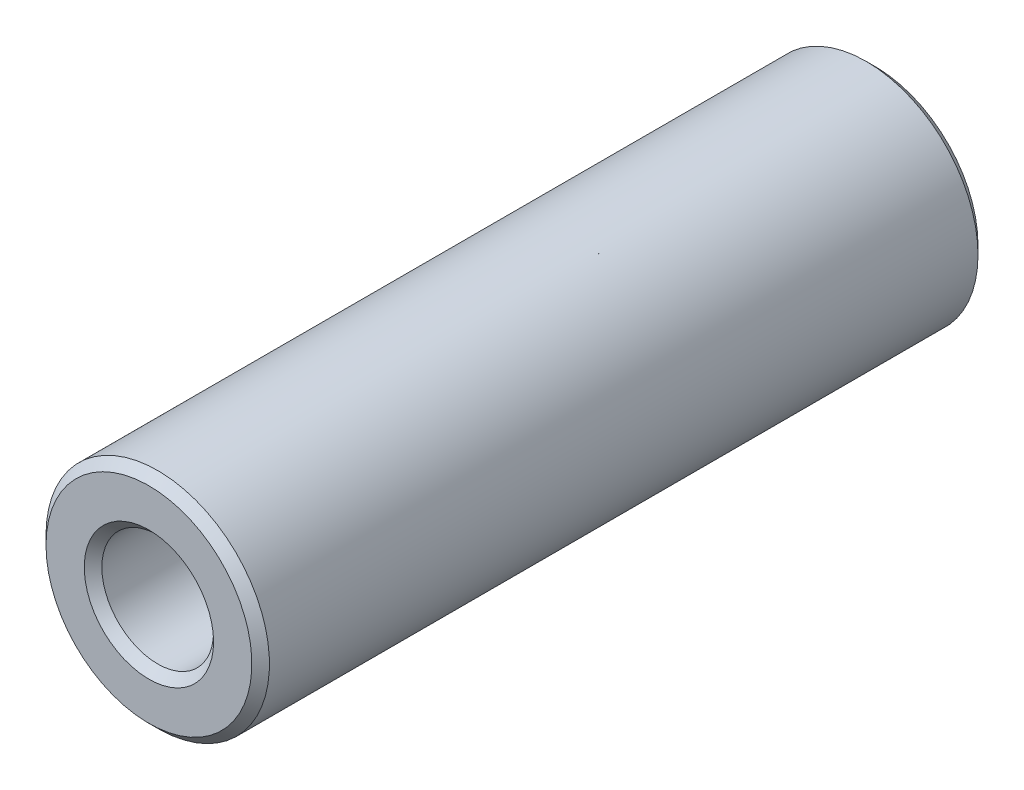
ISO-10303-21;
HEADER;
FILE_DESCRIPTION(('STEP AP214'),'2;1');
FILE_NAME('part.step','',(''),(''),'','','');
FILE_SCHEMA(('AUTOMOTIVE_DESIGN { 1 0 10303 214 1 1 1 1 }'));
ENDSEC;
DATA;
#1=APPLICATION_CONTEXT('core data for automotive mechanical design processes');
#2=APPLICATION_PROTOCOL_DEFINITION('international standard','automotive_design',2000,#1);
#3=PRODUCT_CONTEXT('',#1,'mechanical');
#4=PRODUCT('Part','Part','',(#3));
#5=PRODUCT_RELATED_PRODUCT_CATEGORY('part','',(#4));
#6=PRODUCT_DEFINITION_FORMATION('','',#4);
#7=PRODUCT_DEFINITION_CONTEXT('part definition',#1,'design');
#8=PRODUCT_DEFINITION('design','',#6,#7);
#9=PRODUCT_DEFINITION_SHAPE('','',#8);
#10=(LENGTH_UNIT() NAMED_UNIT(*) SI_UNIT(.MILLI.,.METRE.));
#11=(NAMED_UNIT(*) PLANE_ANGLE_UNIT() SI_UNIT($,.RADIAN.));
#12=(NAMED_UNIT(*) SI_UNIT($,.STERADIAN.) SOLID_ANGLE_UNIT());
#13=UNCERTAINTY_MEASURE_WITH_UNIT(LENGTH_MEASURE(1.E-05),#10,'distance_accuracy_value','');
#14=(GEOMETRIC_REPRESENTATION_CONTEXT(3) GLOBAL_UNCERTAINTY_ASSIGNED_CONTEXT((#13)) GLOBAL_UNIT_ASSIGNED_CONTEXT((#10,
#11,#12)) REPRESENTATION_CONTEXT('',''));
#15=CARTESIAN_POINT('',(0.,0.,0.));
#16=DIRECTION('',(0.,0.,1.));
#17=DIRECTION('',(1.,0.,0.));
#18=AXIS2_PLACEMENT_3D('',#15,#16,#17);
#19=CARTESIAN_POINT('',(0.,0.,41.275));
#20=DIRECTION('',(0.,0.,-1.));
#21=DIRECTION('',(-1.,0.,0.));
#22=AXIS2_PLACEMENT_3D('',#19,#20,#21);
#23=CYLINDRICAL_SURFACE('',#22,3.175);
#24=CARTESIAN_POINT('',(0.,0.,0.499999999988177));
#25=DIRECTION('',(0.,0.,-1.));
#26=DIRECTION('',(-1.,0.,0.));
#27=AXIS2_PLACEMENT_3D('',#24,#25,#26);
#28=CIRCLE('',#27,3.17499999999882);
#29=CARTESIAN_POINT('',(-3.17499999999882,0.,0.499999999988177));
#30=VERTEX_POINT('',#29);
#31=EDGE_CURVE('E30',#30,#30,#28,.T.);
#32=ORIENTED_EDGE('',*,*,#31,.T.);
#33=EDGE_LOOP('',(#32));
#34=FACE_BOUND('',#33,.T.);
#35=CARTESIAN_POINT('',(0.,0.,40.7750000000533));
#36=DIRECTION('',(0.,0.,1.));
#37=DIRECTION('',(1.,0.,0.));
#38=AXIS2_PLACEMENT_3D('',#35,#36,#37);
#39=CIRCLE('',#38,3.17500000005566);
#40=CARTESIAN_POINT('',(3.17500000005566,0.,40.7750000000533));
#41=VERTEX_POINT('',#40);
#42=EDGE_CURVE('E33',#41,#41,#39,.T.);
#43=ORIENTED_EDGE('',*,*,#42,.T.);
#44=EDGE_LOOP('',(#43));
#45=FACE_BOUND('',#44,.T.);
#46=ADVANCED_FACE('F15',(#34,#45),#23,.F.);
#47=CARTESIAN_POINT('',(0.,0.,41.2749999999278));
#48=DIRECTION('',(0.,0.,1.));
#49=DIRECTION('',(1.,0.,0.));
#50=AXIS2_PLACEMENT_3D('',#47,#48,#49);
#51=CONICAL_SURFACE('',#50,3.67499999987331,0.785398163397448);
#52=ORIENTED_EDGE('',*,*,#42,.F.);
#53=EDGE_LOOP('',(#52));
#54=FACE_BOUND('',#53,.T.);
#55=CARTESIAN_POINT('',(0.,0.,41.2749999999846));
#56=DIRECTION('',(0.,0.,1.));
#57=DIRECTION('',(1.,0.,0.));
#58=AXIS2_PLACEMENT_3D('',#55,#56,#57);
#59=CIRCLE('',#58,3.67499999993015);
#60=CARTESIAN_POINT('',(3.67499999993015,0.,41.2749999999846));
#61=VERTEX_POINT('',#60);
#62=EDGE_CURVE('E18',#61,#61,#59,.F.);
#63=ORIENTED_EDGE('',*,*,#62,.F.);
#64=EDGE_LOOP('',(#63));
#65=FACE_BOUND('',#64,.T.);
#66=ADVANCED_FACE('F50',(#54,#65),#51,.F.);
#67=CARTESIAN_POINT('',(0.,0.,5.6843418860808E-11));
#68=DIRECTION('',(0.,0.,-1.));
#69=DIRECTION('',(-1.,0.,0.));
#70=AXIS2_PLACEMENT_3D('',#67,#68,#69);
#71=CONICAL_SURFACE('',#70,3.67499999987331,0.785398163340605);
#72=CARTESIAN_POINT('',(0.,0.,0.));
#73=DIRECTION('',(0.,0.,-1.));
#74=DIRECTION('',(-1.,0.,0.));
#75=AXIS2_PLACEMENT_3D('',#72,#73,#74);
#76=CIRCLE('',#75,3.67499999993015);
#77=CARTESIAN_POINT('',(-3.67499999993015,0.,0.));
#78=VERTEX_POINT('',#77);
#79=EDGE_CURVE('E40',#78,#78,#76,.T.);
#80=ORIENTED_EDGE('',*,*,#79,.T.);
#81=EDGE_LOOP('',(#80));
#82=FACE_BOUND('',#81,.T.);
#83=ORIENTED_EDGE('',*,*,#31,.F.);
#84=EDGE_LOOP('',(#83));
#85=FACE_BOUND('',#84,.T.);
#86=ADVANCED_FACE('F52',(#82,#85),#71,.F.);
#87=CARTESIAN_POINT('',(0.,0.,41.275));
#88=DIRECTION('',(0.,0.,1.));
#89=DIRECTION('',(1.,0.,0.));
#90=AXIS2_PLACEMENT_3D('',#87,#88,#89);
#91=PLANE('',#90);
#92=ORIENTED_EDGE('',*,*,#62,.T.);
#93=EDGE_LOOP('',(#92));
#94=FACE_BOUND('',#93,.T.);
#95=CARTESIAN_POINT('',(0.,0.,41.2750000000415));
#96=DIRECTION('',(0.,0.,-1.));
#97=DIRECTION('',(-1.,0.,0.));
#98=AXIS2_PLACEMENT_3D('',#95,#96,#97);
#99=CIRCLE('',#98,5.85000000000946);
#100=CARTESIAN_POINT('',(-5.85000000000946,0.,41.2750000000415));
#101=VERTEX_POINT('',#100);
#102=EDGE_CURVE('E38',#101,#101,#99,.T.);
#103=ORIENTED_EDGE('',*,*,#102,.F.);
#104=EDGE_LOOP('',(#103));
#105=FACE_BOUND('',#104,.T.);
#106=ADVANCED_FACE('F47',(#94,#105),#91,.T.);
#107=CARTESIAN_POINT('',(0.,0.,0.));
#108=DIRECTION('',(0.,0.,1.));
#109=DIRECTION('',(1.,0.,0.));
#110=AXIS2_PLACEMENT_3D('',#107,#108,#109);
#111=PLANE('',#110);
#112=CARTESIAN_POINT('',(0.,0.,-5.6843418860808E-11));
#113=DIRECTION('',(0.,0.,1.));
#114=DIRECTION('',(1.,0.,0.));
#115=AXIS2_PLACEMENT_3D('',#112,#113,#114);
#116=CIRCLE('',#115,5.84999999995262);
#117=CARTESIAN_POINT('',(5.84999999995262,0.,-5.6843418860808E-11));
#118=VERTEX_POINT('',#117);
#119=EDGE_CURVE('E27',#118,#118,#116,.T.);
#120=ORIENTED_EDGE('',*,*,#119,.F.);
#121=EDGE_LOOP('',(#120));
#122=FACE_BOUND('',#121,.T.);
#123=ORIENTED_EDGE('',*,*,#79,.F.);
#124=EDGE_LOOP('',(#123));
#125=FACE_BOUND('',#124,.T.);
#126=ADVANCED_FACE('F76',(#122,#125),#111,.F.);
#127=CARTESIAN_POINT('',(0.,0.,40.7749999999396));
#128=DIRECTION('',(0.,0.,-1.));
#129=DIRECTION('',(-1.,0.,0.));
#130=AXIS2_PLACEMENT_3D('',#127,#128,#129);
#131=CONICAL_SURFACE('',#130,6.35000000005448,0.785398163340605);
#132=CARTESIAN_POINT('',(0.,0.,40.775));
#133=DIRECTION('',(0.,0.,-1.));
#134=DIRECTION('',(-1.,0.,0.));
#135=AXIS2_PLACEMENT_3D('',#132,#133,#134);
#136=CIRCLE('',#135,6.35);
#137=CARTESIAN_POINT('',(-6.35,0.,40.775));
#138=VERTEX_POINT('',#137);
#139=EDGE_CURVE('E22',#138,#138,#136,.T.);
#140=ORIENTED_EDGE('',*,*,#139,.F.);
#141=EDGE_LOOP('',(#140));
#142=FACE_BOUND('',#141,.T.);
#143=ORIENTED_EDGE('',*,*,#102,.T.);
#144=EDGE_LOOP('',(#143));
#145=FACE_BOUND('',#144,.T.);
#146=ADVANCED_FACE('F69',(#142,#145),#131,.T.);
#147=CARTESIAN_POINT('',(0.,0.,0.499999999931333));
#148=DIRECTION('',(0.,0.,1.));
#149=DIRECTION('',(1.,0.,0.));
#150=AXIS2_PLACEMENT_3D('',#147,#148,#149);
#151=CONICAL_SURFACE('',#150,6.34999999999764,0.785398163454292);
#152=CARTESIAN_POINT('',(0.,0.,0.499999999999994));
#153=DIRECTION('',(0.,0.,-1.));
#154=DIRECTION('',(-1.,0.,0.));
#155=AXIS2_PLACEMENT_3D('',#152,#153,#154);
#156=CIRCLE('',#155,6.35);
#157=CARTESIAN_POINT('',(-6.35,0.,0.499999999999994));
#158=VERTEX_POINT('',#157);
#159=EDGE_CURVE('E10',#158,#158,#156,.F.);
#160=ORIENTED_EDGE('',*,*,#159,.F.);
#161=EDGE_LOOP('',(#160));
#162=FACE_BOUND('',#161,.T.);
#163=ORIENTED_EDGE('',*,*,#119,.T.);
#164=EDGE_LOOP('',(#163));
#165=FACE_BOUND('',#164,.T.);
#166=ADVANCED_FACE('F64',(#162,#165),#151,.T.);
#167=CARTESIAN_POINT('',(0.,0.,41.275));
#168=DIRECTION('',(0.,0.,-1.));
#169=DIRECTION('',(-1.,0.,0.));
#170=AXIS2_PLACEMENT_3D('',#167,#168,#169);
#171=CYLINDRICAL_SURFACE('',#170,6.35);
#172=ORIENTED_EDGE('',*,*,#159,.T.);
#173=EDGE_LOOP('',(#172));
#174=FACE_BOUND('',#173,.T.);
#175=ORIENTED_EDGE('',*,*,#139,.T.);
#176=EDGE_LOOP('',(#175));
#177=FACE_BOUND('',#176,.T.);
#178=ADVANCED_FACE('F62',(#174,#177),#171,.T.);
#179=CLOSED_SHELL('',(#46,#66,#86,#106,#126,#146,#166,#178));
#180=MANIFOLD_SOLID_BREP('B1',#179);
#181=ADVANCED_BREP_SHAPE_REPRESENTATION('',(#18,#180),#14);
#182=SHAPE_DEFINITION_REPRESENTATION(#9,#181);
ENDSEC;
END-ISO-10303-21;
